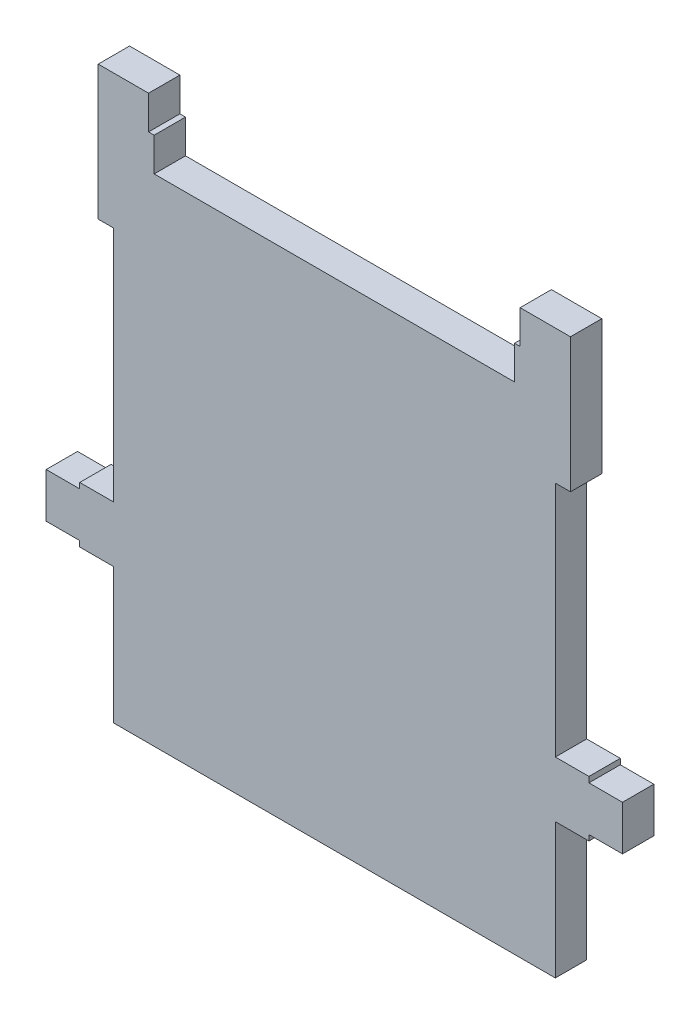
ISO-10303-21;
HEADER;
FILE_DESCRIPTION(('STEP AP214'),'2;1');
FILE_NAME('part.step','',(''),(''),'','','');
FILE_SCHEMA(('AUTOMOTIVE_DESIGN { 1 0 10303 214 1 1 1 1 }'));
ENDSEC;
DATA;
#1=APPLICATION_CONTEXT('core data for automotive mechanical design processes');
#2=APPLICATION_PROTOCOL_DEFINITION('international standard','automotive_design',2000,#1);
#3=PRODUCT_CONTEXT('',#1,'mechanical');
#4=PRODUCT('Part','Part','',(#3));
#5=PRODUCT_RELATED_PRODUCT_CATEGORY('part','',(#4));
#6=PRODUCT_DEFINITION_FORMATION('','',#4);
#7=PRODUCT_DEFINITION_CONTEXT('part definition',#1,'design');
#8=PRODUCT_DEFINITION('design','',#6,#7);
#9=PRODUCT_DEFINITION_SHAPE('','',#8);
#10=(LENGTH_UNIT() NAMED_UNIT(*) SI_UNIT(.MILLI.,.METRE.));
#11=(NAMED_UNIT(*) PLANE_ANGLE_UNIT() SI_UNIT($,.RADIAN.));
#12=(NAMED_UNIT(*) SI_UNIT($,.STERADIAN.) SOLID_ANGLE_UNIT());
#13=UNCERTAINTY_MEASURE_WITH_UNIT(LENGTH_MEASURE(1.E-05),#10,'distance_accuracy_value','');
#14=(GEOMETRIC_REPRESENTATION_CONTEXT(3) GLOBAL_UNCERTAINTY_ASSIGNED_CONTEXT((#13)) GLOBAL_UNIT_ASSIGNED_CONTEXT((#10,
#11,#12)) REPRESENTATION_CONTEXT('',''));
#15=CARTESIAN_POINT('',(0.,0.,0.));
#16=DIRECTION('',(0.,0.,1.));
#17=DIRECTION('',(1.,0.,0.));
#18=AXIS2_PLACEMENT_3D('',#15,#16,#17);
#19=CARTESIAN_POINT('',(-1.97499732,-2.51499878,0.));
#20=DIRECTION('',(0.,0.,-1.));
#21=DIRECTION('',(0.,-1.,0.));
#22=AXIS2_PLACEMENT_3D('',#19,#20,#21);
#23=PLANE('',#22);
#24=DIRECTION('',(0.,1.,0.));
#25=VECTOR('',#24,1.);
#26=CARTESIAN_POINT('',(1.97499986,-1.30499866,0.));
#27=LINE('',#26,#25);
#28=CARTESIAN_POINT('',(1.97499986,-2.51499878,0.));
#29=VERTEX_POINT('',#28);
#30=CARTESIAN_POINT('',(1.97499986,-1.30499866,0.));
#31=VERTEX_POINT('',#30);
#32=EDGE_CURVE('E442',#29,#31,#27,.T.);
#33=ORIENTED_EDGE('',*,*,#32,.F.);
#34=DIRECTION('',(1.,0.,0.));
#35=VECTOR('',#34,1.);
#36=CARTESIAN_POINT('',(1.97499986,-2.51499878,0.));
#37=LINE('',#36,#35);
#38=CARTESIAN_POINT('',(-1.97499732,-2.51499878,0.));
#39=VERTEX_POINT('',#38);
#40=EDGE_CURVE('E323',#39,#29,#37,.T.);
#41=ORIENTED_EDGE('',*,*,#40,.F.);
#42=DIRECTION('',(0.,-1.,0.));
#43=VECTOR('',#42,1.);
#44=CARTESIAN_POINT('',(-1.97499732,-2.51499878,0.));
#45=LINE('',#44,#43);
#46=CARTESIAN_POINT('',(-1.97499732,-1.30499866,0.));
#47=VERTEX_POINT('',#46);
#48=EDGE_CURVE('E11',#47,#39,#45,.T.);
#49=ORIENTED_EDGE('',*,*,#48,.F.);
#50=DIRECTION('',(1.,0.,0.));
#51=VECTOR('',#50,1.);
#52=CARTESIAN_POINT('',(-1.97499732,-1.30499866,0.));
#53=LINE('',#52,#51);
#54=CARTESIAN_POINT('',(-2.27499926,-1.30499866,0.));
#55=VERTEX_POINT('',#54);
#56=EDGE_CURVE('E487',#55,#47,#53,.T.);
#57=ORIENTED_EDGE('',*,*,#56,.F.);
#58=DIRECTION('',(0.,-1.,0.));
#59=VECTOR('',#58,1.);
#60=CARTESIAN_POINT('',(-2.27499926,-1.30499866,0.));
#61=LINE('',#60,#59);
#62=CARTESIAN_POINT('',(-2.27499926,-1.25499876,0.));
#63=VERTEX_POINT('',#62);
#64=EDGE_CURVE('E467',#63,#55,#61,.T.);
#65=ORIENTED_EDGE('',*,*,#64,.F.);
#66=DIRECTION('',(1.,0.,0.));
#67=VECTOR('',#66,1.);
#68=CARTESIAN_POINT('',(-2.27499926,-1.25499876,0.));
#69=LINE('',#68,#67);
#70=CARTESIAN_POINT('',(-2.57499866,-1.25499876,0.));
#71=VERTEX_POINT('',#70);
#72=EDGE_CURVE('E345',#71,#63,#69,.T.);
#73=ORIENTED_EDGE('',*,*,#72,.F.);
#74=DIRECTION('',(0.,-1.,0.));
#75=VECTOR('',#74,1.);
#76=CARTESIAN_POINT('',(-2.57499866,-1.25499876,0.));
#77=LINE('',#76,#75);
#78=CARTESIAN_POINT('',(-2.57499866,-0.85499956,0.));
#79=VERTEX_POINT('',#78);
#80=EDGE_CURVE('E346',#79,#71,#77,.T.);
#81=ORIENTED_EDGE('',*,*,#80,.F.);
#82=DIRECTION('',(-1.,0.,0.));
#83=VECTOR('',#82,1.);
#84=CARTESIAN_POINT('',(-2.57499866,-0.85499956,0.));
#85=LINE('',#84,#83);
#86=CARTESIAN_POINT('',(-2.27499926,-0.85499956,0.));
#87=VERTEX_POINT('',#86);
#88=EDGE_CURVE('E331',#87,#79,#85,.T.);
#89=ORIENTED_EDGE('',*,*,#88,.F.);
#90=DIRECTION('',(0.,-1.,0.));
#91=VECTOR('',#90,1.);
#92=CARTESIAN_POINT('',(-2.27499926,-0.85499956,0.));
#93=LINE('',#92,#91);
#94=CARTESIAN_POINT('',(-2.27499926,-0.80499966,0.));
#95=VERTEX_POINT('',#94);
#96=EDGE_CURVE('E20',#95,#87,#93,.T.);
#97=ORIENTED_EDGE('',*,*,#96,.F.);
#98=DIRECTION('',(-1.,0.,0.));
#99=VECTOR('',#98,1.);
#100=CARTESIAN_POINT('',(-2.27499926,-0.80499966,0.));
#101=LINE('',#100,#99);
#102=CARTESIAN_POINT('',(-1.97499732,-0.80499966,0.));
#103=VERTEX_POINT('',#102);
#104=EDGE_CURVE('E402',#103,#95,#101,.T.);
#105=ORIENTED_EDGE('',*,*,#104,.F.);
#106=DIRECTION('',(0.,-1.,0.));
#107=VECTOR('',#106,1.);
#108=CARTESIAN_POINT('',(-1.97499732,-0.80499966,0.));
#109=LINE('',#108,#107);
#110=CARTESIAN_POINT('',(-1.97499732,1.31500118,0.));
#111=VERTEX_POINT('',#110);
#112=EDGE_CURVE('E391',#111,#103,#109,.T.);
#113=ORIENTED_EDGE('',*,*,#112,.F.);
#114=DIRECTION('',(1.,0.,0.));
#115=VECTOR('',#114,1.);
#116=CARTESIAN_POINT('',(-1.97499732,1.31500118,0.));
#117=LINE('',#116,#115);
#118=CARTESIAN_POINT('',(-2.10999832,1.31500118,0.));
#119=VERTEX_POINT('',#118);
#120=EDGE_CURVE('E405',#119,#111,#117,.T.);
#121=ORIENTED_EDGE('',*,*,#120,.F.);
#122=DIRECTION('',(0.,-1.,0.));
#123=VECTOR('',#122,1.);
#124=CARTESIAN_POINT('',(-2.10999832,1.31500118,0.));
#125=LINE('',#124,#123);
#126=CARTESIAN_POINT('',(-2.10999832,2.51500132,0.));
#127=VERTEX_POINT('',#126);
#128=EDGE_CURVE('E386',#127,#119,#125,.T.);
#129=ORIENTED_EDGE('',*,*,#128,.F.);
#130=DIRECTION('',(-1.,0.,0.));
#131=VECTOR('',#130,1.);
#132=CARTESIAN_POINT('',(-2.10999832,2.51500132,0.));
#133=LINE('',#132,#131);
#134=CARTESIAN_POINT('',(-1.65999922,2.51500132,0.));
#135=VERTEX_POINT('',#134);
#136=EDGE_CURVE('E321',#135,#127,#133,.T.);
#137=ORIENTED_EDGE('',*,*,#136,.F.);
#138=DIRECTION('',(0.,1.,0.));
#139=VECTOR('',#138,1.);
#140=CARTESIAN_POINT('',(-1.65999922,2.51500132,0.));
#141=LINE('',#140,#139);
#142=CARTESIAN_POINT('',(-1.65999922,2.21500192,0.));
#143=VERTEX_POINT('',#142);
#144=EDGE_CURVE('E383',#143,#135,#141,.T.);
#145=ORIENTED_EDGE('',*,*,#144,.F.);
#146=DIRECTION('',(-1.,0.,0.));
#147=VECTOR('',#146,1.);
#148=CARTESIAN_POINT('',(-1.65999922,2.21500192,0.));
#149=LINE('',#148,#147);
#150=CARTESIAN_POINT('',(-1.60999932,2.21500192,0.));
#151=VERTEX_POINT('',#150);
#152=EDGE_CURVE('E465',#151,#143,#149,.T.);
#153=ORIENTED_EDGE('',*,*,#152,.F.);
#154=DIRECTION('',(0.,1.,0.));
#155=VECTOR('',#154,1.);
#156=CARTESIAN_POINT('',(-1.60999932,2.21500192,0.));
#157=LINE('',#156,#155);
#158=CARTESIAN_POINT('',(-1.60999932,1.91499998,0.));
#159=VERTEX_POINT('',#158);
#160=EDGE_CURVE('E466',#159,#151,#157,.T.);
#161=ORIENTED_EDGE('',*,*,#160,.F.);
#162=DIRECTION('',(-1.,0.,0.));
#163=VECTOR('',#162,1.);
#164=CARTESIAN_POINT('',(-1.60999932,1.91499998,0.));
#165=LINE('',#164,#163);
#166=CARTESIAN_POINT('',(1.61000186,1.91499998,0.));
#167=VERTEX_POINT('',#166);
#168=EDGE_CURVE('E525',#167,#159,#165,.T.);
#169=ORIENTED_EDGE('',*,*,#168,.F.);
#170=DIRECTION('',(0.,-1.,0.));
#171=VECTOR('',#170,1.);
#172=CARTESIAN_POINT('',(1.61000186,1.91499998,0.));
#173=LINE('',#172,#171);
#174=CARTESIAN_POINT('',(1.61000186,2.21500192,0.));
#175=VERTEX_POINT('',#174);
#176=EDGE_CURVE('E379',#175,#167,#173,.T.);
#177=ORIENTED_EDGE('',*,*,#176,.F.);
#178=DIRECTION('',(-1.,0.,0.));
#179=VECTOR('',#178,1.);
#180=CARTESIAN_POINT('',(1.61000186,2.21500192,0.));
#181=LINE('',#180,#179);
#182=CARTESIAN_POINT('',(1.66000176,2.21500192,0.));
#183=VERTEX_POINT('',#182);
#184=EDGE_CURVE('E291',#183,#175,#181,.T.);
#185=ORIENTED_EDGE('',*,*,#184,.F.);
#186=DIRECTION('',(0.,-1.,0.));
#187=VECTOR('',#186,1.);
#188=CARTESIAN_POINT('',(1.66000176,2.21500192,0.));
#189=LINE('',#188,#187);
#190=CARTESIAN_POINT('',(1.66000176,2.51500132,0.));
#191=VERTEX_POINT('',#190);
#192=EDGE_CURVE('E285',#191,#183,#189,.T.);
#193=ORIENTED_EDGE('',*,*,#192,.F.);
#194=DIRECTION('',(-1.,0.,0.));
#195=VECTOR('',#194,1.);
#196=CARTESIAN_POINT('',(1.66000176,2.51500132,0.));
#197=LINE('',#196,#195);
#198=CARTESIAN_POINT('',(2.11000086,2.51500132,0.));
#199=VERTEX_POINT('',#198);
#200=EDGE_CURVE('E288',#199,#191,#197,.T.);
#201=ORIENTED_EDGE('',*,*,#200,.F.);
#202=DIRECTION('',(0.,1.,0.));
#203=VECTOR('',#202,1.);
#204=CARTESIAN_POINT('',(2.11000086,2.51500132,0.));
#205=LINE('',#204,#203);
#206=CARTESIAN_POINT('',(2.11000086,1.31500118,0.));
#207=VERTEX_POINT('',#206);
#208=EDGE_CURVE('E317',#207,#199,#205,.T.);
#209=ORIENTED_EDGE('',*,*,#208,.F.);
#210=DIRECTION('',(1.,0.,0.));
#211=VECTOR('',#210,1.);
#212=CARTESIAN_POINT('',(2.11000086,1.31500118,0.));
#213=LINE('',#212,#211);
#214=CARTESIAN_POINT('',(1.97499986,1.31500118,0.));
#215=VERTEX_POINT('',#214);
#216=EDGE_CURVE('E365',#215,#207,#213,.T.);
#217=ORIENTED_EDGE('',*,*,#216,.F.);
#218=DIRECTION('',(0.,1.,0.));
#219=VECTOR('',#218,1.);
#220=CARTESIAN_POINT('',(1.97499986,1.31500118,0.));
#221=LINE('',#220,#219);
#222=CARTESIAN_POINT('',(1.97499986,-0.80499966,0.));
#223=VERTEX_POINT('',#222);
#224=EDGE_CURVE('E352',#223,#215,#221,.T.);
#225=ORIENTED_EDGE('',*,*,#224,.F.);
#226=DIRECTION('',(-1.,0.,0.));
#227=VECTOR('',#226,1.);
#228=CARTESIAN_POINT('',(1.97499986,-0.80499966,0.));
#229=LINE('',#228,#227);
#230=CARTESIAN_POINT('',(2.2750018,-0.80499966,0.));
#231=VERTEX_POINT('',#230);
#232=EDGE_CURVE('E350',#231,#223,#229,.T.);
#233=ORIENTED_EDGE('',*,*,#232,.F.);
#234=DIRECTION('',(0.,1.,0.));
#235=VECTOR('',#234,1.);
#236=CARTESIAN_POINT('',(2.2750018,-0.80499966,0.));
#237=LINE('',#236,#235);
#238=CARTESIAN_POINT('',(2.2750018,-0.85499956,0.));
#239=VERTEX_POINT('',#238);
#240=EDGE_CURVE('E351',#239,#231,#237,.T.);
#241=ORIENTED_EDGE('',*,*,#240,.F.);
#242=DIRECTION('',(-1.,0.,0.));
#243=VECTOR('',#242,1.);
#244=CARTESIAN_POINT('',(2.2750018,-0.85499956,0.));
#245=LINE('',#244,#243);
#246=CARTESIAN_POINT('',(2.5750012,-0.85499956,0.));
#247=VERTEX_POINT('',#246);
#248=EDGE_CURVE('E516',#247,#239,#245,.T.);
#249=ORIENTED_EDGE('',*,*,#248,.F.);
#250=DIRECTION('',(0.,1.,0.));
#251=VECTOR('',#250,1.);
#252=CARTESIAN_POINT('',(2.5750012,-0.85499956,0.));
#253=LINE('',#252,#251);
#254=CARTESIAN_POINT('',(2.5750012,-1.25499876,0.));
#255=VERTEX_POINT('',#254);
#256=EDGE_CURVE('E456',#255,#247,#253,.T.);
#257=ORIENTED_EDGE('',*,*,#256,.F.);
#258=DIRECTION('',(1.,0.,0.));
#259=VECTOR('',#258,1.);
#260=CARTESIAN_POINT('',(2.5750012,-1.25499876,0.));
#261=LINE('',#260,#259);
#262=CARTESIAN_POINT('',(2.2750018,-1.25499876,0.));
#263=VERTEX_POINT('',#262);
#264=EDGE_CURVE('E454',#263,#255,#261,.T.);
#265=ORIENTED_EDGE('',*,*,#264,.F.);
#266=DIRECTION('',(0.,1.,0.));
#267=VECTOR('',#266,1.);
#268=CARTESIAN_POINT('',(2.2750018,-1.25499876,0.));
#269=LINE('',#268,#267);
#270=CARTESIAN_POINT('',(2.2750018,-1.30499866,0.));
#271=VERTEX_POINT('',#270);
#272=EDGE_CURVE('E455',#271,#263,#269,.T.);
#273=ORIENTED_EDGE('',*,*,#272,.F.);
#274=DIRECTION('',(1.,0.,0.));
#275=VECTOR('',#274,1.);
#276=CARTESIAN_POINT('',(2.2750018,-1.30499866,0.));
#277=LINE('',#276,#275);
#278=EDGE_CURVE('E370',#31,#271,#277,.T.);
#279=ORIENTED_EDGE('',*,*,#278,.F.);
#280=EDGE_LOOP('',(#33,#41,#49,#57,#65,#73,#81,#89,#97,#105,#113,#121,#129,#137,#145,#153,#161,
#169,#177,#185,#193,#201,#209,#217,#225,#233,#241,#249,#257,#265,#273,#279));
#281=FACE_BOUND('',#280,.T.);
#282=ADVANCED_FACE('F16',(#281),#23,.T.);
#283=CARTESIAN_POINT('',(-1.97499732,-2.51499878,0.));
#284=DIRECTION('',(-1.,0.,0.));
#285=DIRECTION('',(0.,0.,1.));
#286=AXIS2_PLACEMENT_3D('',#283,#284,#285);
#287=PLANE('',#286);
#288=DIRECTION('',(0.,0.,1.));
#289=VECTOR('',#288,1.);
#290=CARTESIAN_POINT('',(-1.97499732,-1.30499866,0.));
#291=LINE('',#290,#289);
#292=CARTESIAN_POINT('',(-1.97499732,-1.30499866,0.27999944));
#293=VERTEX_POINT('',#292);
#294=EDGE_CURVE('E27',#47,#293,#291,.T.);
#295=ORIENTED_EDGE('',*,*,#294,.F.);
#296=ORIENTED_EDGE('',*,*,#48,.T.);
#297=DIRECTION('',(0.,0.,-1.));
#298=VECTOR('',#297,1.);
#299=CARTESIAN_POINT('',(-1.97499732,-2.51499878,0.));
#300=LINE('',#299,#298);
#301=CARTESIAN_POINT('',(-1.97499732,-2.51499878,0.27999944));
#302=VERTEX_POINT('',#301);
#303=EDGE_CURVE('E327',#302,#39,#300,.T.);
#304=ORIENTED_EDGE('',*,*,#303,.F.);
#305=DIRECTION('',(0.,1.,0.));
#306=VECTOR('',#305,1.);
#307=CARTESIAN_POINT('',(-1.97499732,-2.51499878,0.27999944));
#308=LINE('',#307,#306);
#309=EDGE_CURVE('E552',#302,#293,#308,.T.);
#310=ORIENTED_EDGE('',*,*,#309,.T.);
#311=EDGE_LOOP('',(#295,#296,#304,#310));
#312=FACE_BOUND('',#311,.T.);
#313=ADVANCED_FACE('F666',(#312),#287,.T.);
#314=CARTESIAN_POINT('',(-1.97499732,-1.30499866,0.));
#315=DIRECTION('',(0.,-1.,0.));
#316=DIRECTION('',(0.,0.,-1.));
#317=AXIS2_PLACEMENT_3D('',#314,#315,#316);
#318=PLANE('',#317);
#319=DIRECTION('',(0.,0.,1.));
#320=VECTOR('',#319,1.);
#321=CARTESIAN_POINT('',(-2.27499926,-1.30499866,0.));
#322=LINE('',#321,#320);
#323=CARTESIAN_POINT('',(-2.27499926,-1.30499866,0.27999944));
#324=VERTEX_POINT('',#323);
#325=EDGE_CURVE('E471',#55,#324,#322,.T.);
#326=ORIENTED_EDGE('',*,*,#325,.F.);
#327=ORIENTED_EDGE('',*,*,#56,.T.);
#328=ORIENTED_EDGE('',*,*,#294,.T.);
#329=DIRECTION('',(-1.,0.,0.));
#330=VECTOR('',#329,1.);
#331=CARTESIAN_POINT('',(-1.97499732,-1.30499866,0.27999944));
#332=LINE('',#331,#330);
#333=EDGE_CURVE('E521',#293,#324,#332,.T.);
#334=ORIENTED_EDGE('',*,*,#333,.T.);
#335=EDGE_LOOP('',(#326,#327,#328,#334));
#336=FACE_BOUND('',#335,.T.);
#337=ADVANCED_FACE('F664',(#336),#318,.T.);
#338=CARTESIAN_POINT('',(-2.27499926,-1.30499866,0.));
#339=DIRECTION('',(-1.,0.,0.));
#340=DIRECTION('',(0.,0.,1.));
#341=AXIS2_PLACEMENT_3D('',#338,#339,#340);
#342=PLANE('',#341);
#343=DIRECTION('',(0.,0.,1.));
#344=VECTOR('',#343,1.);
#345=CARTESIAN_POINT('',(-2.27499926,-1.25499876,0.));
#346=LINE('',#345,#344);
#347=CARTESIAN_POINT('',(-2.27499926,-1.25499876,0.27999944));
#348=VERTEX_POINT('',#347);
#349=EDGE_CURVE('E361',#63,#348,#346,.T.);
#350=ORIENTED_EDGE('',*,*,#349,.F.);
#351=ORIENTED_EDGE('',*,*,#64,.T.);
#352=ORIENTED_EDGE('',*,*,#325,.T.);
#353=DIRECTION('',(0.,1.,0.));
#354=VECTOR('',#353,1.);
#355=CARTESIAN_POINT('',(-2.27499926,-2.51499878,0.27999944));
#356=LINE('',#355,#354);
#357=EDGE_CURVE('E517',#324,#348,#356,.T.);
#358=ORIENTED_EDGE('',*,*,#357,.T.);
#359=EDGE_LOOP('',(#350,#351,#352,#358));
#360=FACE_BOUND('',#359,.T.);
#361=ADVANCED_FACE('F659',(#360),#342,.T.);
#362=CARTESIAN_POINT('',(-2.27499926,-1.25499876,0.));
#363=DIRECTION('',(0.,-1.,0.));
#364=DIRECTION('',(0.,0.,-1.));
#365=AXIS2_PLACEMENT_3D('',#362,#363,#364);
#366=PLANE('',#365);
#367=DIRECTION('',(0.,0.,1.));
#368=VECTOR('',#367,1.);
#369=CARTESIAN_POINT('',(-2.57499866,-1.25499876,0.));
#370=LINE('',#369,#368);
#371=CARTESIAN_POINT('',(-2.57499866,-1.25499876,0.27999944));
#372=VERTEX_POINT('',#371);
#373=EDGE_CURVE('E342',#71,#372,#370,.T.);
#374=ORIENTED_EDGE('',*,*,#373,.F.);
#375=ORIENTED_EDGE('',*,*,#72,.T.);
#376=ORIENTED_EDGE('',*,*,#349,.T.);
#377=DIRECTION('',(-1.,0.,0.));
#378=VECTOR('',#377,1.);
#379=CARTESIAN_POINT('',(-1.97499732,-1.25499876,0.27999944));
#380=LINE('',#379,#378);
#381=EDGE_CURVE('E498',#348,#372,#380,.T.);
#382=ORIENTED_EDGE('',*,*,#381,.T.);
#383=EDGE_LOOP('',(#374,#375,#376,#382));
#384=FACE_BOUND('',#383,.T.);
#385=ADVANCED_FACE('F645',(#384),#366,.T.);
#386=CARTESIAN_POINT('',(-2.57499866,-1.25499876,0.));
#387=DIRECTION('',(-1.,0.,0.));
#388=DIRECTION('',(0.,0.,1.));
#389=AXIS2_PLACEMENT_3D('',#386,#387,#388);
#390=PLANE('',#389);
#391=DIRECTION('',(0.,0.,1.));
#392=VECTOR('',#391,1.);
#393=CARTESIAN_POINT('',(-2.57499866,-0.85499956,0.));
#394=LINE('',#393,#392);
#395=CARTESIAN_POINT('',(-2.57499866,-0.85499956,0.27999944));
#396=VERTEX_POINT('',#395);
#397=EDGE_CURVE('E423',#79,#396,#394,.T.);
#398=ORIENTED_EDGE('',*,*,#397,.F.);
#399=ORIENTED_EDGE('',*,*,#80,.T.);
#400=ORIENTED_EDGE('',*,*,#373,.T.);
#401=DIRECTION('',(0.,1.,0.));
#402=VECTOR('',#401,1.);
#403=CARTESIAN_POINT('',(-2.57499866,-2.51499878,0.27999944));
#404=LINE('',#403,#402);
#405=EDGE_CURVE('E340',#372,#396,#404,.T.);
#406=ORIENTED_EDGE('',*,*,#405,.T.);
#407=EDGE_LOOP('',(#398,#399,#400,#406));
#408=FACE_BOUND('',#407,.T.);
#409=ADVANCED_FACE('F655',(#408),#390,.T.);
#410=CARTESIAN_POINT('',(-2.57499866,-0.85499956,0.));
#411=DIRECTION('',(0.,1.,0.));
#412=DIRECTION('',(1.,0.,0.));
#413=AXIS2_PLACEMENT_3D('',#410,#411,#412);
#414=PLANE('',#413);
#415=DIRECTION('',(0.,0.,1.));
#416=VECTOR('',#415,1.);
#417=CARTESIAN_POINT('',(-2.27499926,-0.85499956,0.));
#418=LINE('',#417,#416);
#419=CARTESIAN_POINT('',(-2.27499926,-0.85499956,0.27999944));
#420=VERTEX_POINT('',#419);
#421=EDGE_CURVE('E328',#87,#420,#418,.T.);
#422=ORIENTED_EDGE('',*,*,#421,.F.);
#423=ORIENTED_EDGE('',*,*,#88,.T.);
#424=ORIENTED_EDGE('',*,*,#397,.T.);
#425=DIRECTION('',(1.,0.,0.));
#426=VECTOR('',#425,1.);
#427=CARTESIAN_POINT('',(-1.97499732,-0.85499956,0.27999944));
#428=LINE('',#427,#426);
#429=EDGE_CURVE('E336',#396,#420,#428,.T.);
#430=ORIENTED_EDGE('',*,*,#429,.T.);
#431=EDGE_LOOP('',(#422,#423,#424,#430));
#432=FACE_BOUND('',#431,.T.);
#433=ADVANCED_FACE('F974',(#432),#414,.T.);
#434=CARTESIAN_POINT('',(-2.27499926,-0.85499956,0.));
#435=DIRECTION('',(-1.,0.,0.));
#436=DIRECTION('',(0.,0.,1.));
#437=AXIS2_PLACEMENT_3D('',#434,#435,#436);
#438=PLANE('',#437);
#439=DIRECTION('',(0.,0.,1.));
#440=VECTOR('',#439,1.);
#441=CARTESIAN_POINT('',(-2.27499926,-0.80499966,0.));
#442=LINE('',#441,#440);
#443=CARTESIAN_POINT('',(-2.27499926,-0.80499966,0.27999944));
#444=VERTEX_POINT('',#443);
#445=EDGE_CURVE('E630',#95,#444,#442,.T.);
#446=ORIENTED_EDGE('',*,*,#445,.F.);
#447=ORIENTED_EDGE('',*,*,#96,.T.);
#448=ORIENTED_EDGE('',*,*,#421,.T.);
#449=DIRECTION('',(0.,1.,0.));
#450=VECTOR('',#449,1.);
#451=CARTESIAN_POINT('',(-2.27499926,-2.51499878,0.27999944));
#452=LINE('',#451,#450);
#453=EDGE_CURVE('E341',#420,#444,#452,.T.);
#454=ORIENTED_EDGE('',*,*,#453,.T.);
#455=EDGE_LOOP('',(#446,#447,#448,#454));
#456=FACE_BOUND('',#455,.T.);
#457=ADVANCED_FACE('F692',(#456),#438,.T.);
#458=CARTESIAN_POINT('',(-2.27499926,-0.80499966,0.));
#459=DIRECTION('',(0.,1.,0.));
#460=DIRECTION('',(1.,0.,0.));
#461=AXIS2_PLACEMENT_3D('',#458,#459,#460);
#462=PLANE('',#461);
#463=DIRECTION('',(0.,0.,1.));
#464=VECTOR('',#463,1.);
#465=CARTESIAN_POINT('',(-1.97499732,-0.80499966,0.));
#466=LINE('',#465,#464);
#467=CARTESIAN_POINT('',(-1.97499732,-0.80499966,0.27999944));
#468=VERTEX_POINT('',#467);
#469=EDGE_CURVE('E394',#103,#468,#466,.T.);
#470=ORIENTED_EDGE('',*,*,#469,.F.);
#471=ORIENTED_EDGE('',*,*,#104,.T.);
#472=ORIENTED_EDGE('',*,*,#445,.T.);
#473=DIRECTION('',(1.,0.,0.));
#474=VECTOR('',#473,1.);
#475=CARTESIAN_POINT('',(-1.97499732,-0.80499966,0.27999944));
#476=LINE('',#475,#474);
#477=EDGE_CURVE('E478',#444,#468,#476,.T.);
#478=ORIENTED_EDGE('',*,*,#477,.T.);
#479=EDGE_LOOP('',(#470,#471,#472,#478));
#480=FACE_BOUND('',#479,.T.);
#481=ADVANCED_FACE('F688',(#480),#462,.T.);
#482=CARTESIAN_POINT('',(-1.97499732,-0.80499966,0.));
#483=DIRECTION('',(-1.,0.,0.));
#484=DIRECTION('',(0.,0.,1.));
#485=AXIS2_PLACEMENT_3D('',#482,#483,#484);
#486=PLANE('',#485);
#487=DIRECTION('',(0.,0.,1.));
#488=VECTOR('',#487,1.);
#489=CARTESIAN_POINT('',(-1.97499732,1.31500118,0.));
#490=LINE('',#489,#488);
#491=CARTESIAN_POINT('',(-1.97499732,1.31500118,0.27999944));
#492=VERTEX_POINT('',#491);
#493=EDGE_CURVE('E395',#111,#492,#490,.T.);
#494=ORIENTED_EDGE('',*,*,#493,.F.);
#495=ORIENTED_EDGE('',*,*,#112,.T.);
#496=ORIENTED_EDGE('',*,*,#469,.T.);
#497=DIRECTION('',(0.,1.,0.));
#498=VECTOR('',#497,1.);
#499=CARTESIAN_POINT('',(-1.97499732,-2.51499878,0.27999944));
#500=LINE('',#499,#498);
#501=EDGE_CURVE('E482',#468,#492,#500,.T.);
#502=ORIENTED_EDGE('',*,*,#501,.T.);
#503=EDGE_LOOP('',(#494,#495,#496,#502));
#504=FACE_BOUND('',#503,.T.);
#505=ADVANCED_FACE('F697',(#504),#486,.T.);
#506=CARTESIAN_POINT('',(-1.97499732,1.31500118,0.));
#507=DIRECTION('',(0.,-1.,0.));
#508=DIRECTION('',(0.,0.,-1.));
#509=AXIS2_PLACEMENT_3D('',#506,#507,#508);
#510=PLANE('',#509);
#511=DIRECTION('',(0.,0.,1.));
#512=VECTOR('',#511,1.);
#513=CARTESIAN_POINT('',(-2.10999832,1.31500118,0.));
#514=LINE('',#513,#512);
#515=CARTESIAN_POINT('',(-2.10999832,1.31500118,0.27999944));
#516=VERTEX_POINT('',#515);
#517=EDGE_CURVE('E389',#119,#516,#514,.T.);
#518=ORIENTED_EDGE('',*,*,#517,.F.);
#519=ORIENTED_EDGE('',*,*,#120,.T.);
#520=ORIENTED_EDGE('',*,*,#493,.T.);
#521=DIRECTION('',(-1.,0.,0.));
#522=VECTOR('',#521,1.);
#523=CARTESIAN_POINT('',(-1.97499732,1.31500118,0.27999944));
#524=LINE('',#523,#522);
#525=EDGE_CURVE('E571',#492,#516,#524,.T.);
#526=ORIENTED_EDGE('',*,*,#525,.T.);
#527=EDGE_LOOP('',(#518,#519,#520,#526));
#528=FACE_BOUND('',#527,.T.);
#529=ADVANCED_FACE('F699',(#528),#510,.T.);
#530=CARTESIAN_POINT('',(-2.10999832,1.31500118,0.));
#531=DIRECTION('',(-1.,0.,0.));
#532=DIRECTION('',(0.,0.,1.));
#533=AXIS2_PLACEMENT_3D('',#530,#531,#532);
#534=PLANE('',#533);
#535=DIRECTION('',(0.,0.,1.));
#536=VECTOR('',#535,1.);
#537=CARTESIAN_POINT('',(-2.10999832,2.51500132,0.));
#538=LINE('',#537,#536);
#539=CARTESIAN_POINT('',(-2.10999832,2.51500132,0.27999944));
#540=VERTEX_POINT('',#539);
#541=EDGE_CURVE('E390',#127,#540,#538,.T.);
#542=ORIENTED_EDGE('',*,*,#541,.F.);
#543=ORIENTED_EDGE('',*,*,#128,.T.);
#544=ORIENTED_EDGE('',*,*,#517,.T.);
#545=DIRECTION('',(0.,1.,0.));
#546=VECTOR('',#545,1.);
#547=CARTESIAN_POINT('',(-2.10999832,-2.51499878,0.27999944));
#548=LINE('',#547,#546);
#549=EDGE_CURVE('E574',#516,#540,#548,.T.);
#550=ORIENTED_EDGE('',*,*,#549,.T.);
#551=EDGE_LOOP('',(#542,#543,#544,#550));
#552=FACE_BOUND('',#551,.T.);
#553=ADVANCED_FACE('F704',(#552),#534,.T.);
#554=CARTESIAN_POINT('',(-2.10999832,2.51500132,0.));
#555=DIRECTION('',(0.,1.,0.));
#556=DIRECTION('',(1.,0.,0.));
#557=AXIS2_PLACEMENT_3D('',#554,#555,#556);
#558=PLANE('',#557);
#559=DIRECTION('',(0.,0.,1.));
#560=VECTOR('',#559,1.);
#561=CARTESIAN_POINT('',(-1.65999922,2.51500132,0.));
#562=LINE('',#561,#560);
#563=CARTESIAN_POINT('',(-1.65999922,2.51500132,0.27999944));
#564=VERTEX_POINT('',#563);
#565=EDGE_CURVE('E380',#135,#564,#562,.T.);
#566=ORIENTED_EDGE('',*,*,#565,.F.);
#567=ORIENTED_EDGE('',*,*,#136,.T.);
#568=ORIENTED_EDGE('',*,*,#541,.T.);
#569=DIRECTION('',(1.,0.,0.));
#570=VECTOR('',#569,1.);
#571=CARTESIAN_POINT('',(-1.97499732,2.51500132,0.27999944));
#572=LINE('',#571,#570);
#573=EDGE_CURVE('E590',#540,#564,#572,.T.);
#574=ORIENTED_EDGE('',*,*,#573,.T.);
#575=EDGE_LOOP('',(#566,#567,#568,#574));
#576=FACE_BOUND('',#575,.T.);
#577=ADVANCED_FACE('F707',(#576),#558,.T.);
#578=CARTESIAN_POINT('',(-1.65999922,2.51500132,0.));
#579=DIRECTION('',(1.,0.,0.));
#580=DIRECTION('',(0.,1.,0.));
#581=AXIS2_PLACEMENT_3D('',#578,#579,#580);
#582=PLANE('',#581);
#583=DIRECTION('',(0.,0.,1.));
#584=VECTOR('',#583,1.);
#585=CARTESIAN_POINT('',(-1.65999922,2.21500192,0.));
#586=LINE('',#585,#584);
#587=CARTESIAN_POINT('',(-1.65999922,2.21500192,0.27999944));
#588=VERTEX_POINT('',#587);
#589=EDGE_CURVE('E505',#143,#588,#586,.T.);
#590=ORIENTED_EDGE('',*,*,#589,.F.);
#591=ORIENTED_EDGE('',*,*,#144,.T.);
#592=ORIENTED_EDGE('',*,*,#565,.T.);
#593=DIRECTION('',(0.,-1.,0.));
#594=VECTOR('',#593,1.);
#595=CARTESIAN_POINT('',(-1.65999922,-2.51499878,0.27999944));
#596=LINE('',#595,#594);
#597=EDGE_CURVE('E486',#564,#588,#596,.T.);
#598=ORIENTED_EDGE('',*,*,#597,.T.);
#599=EDGE_LOOP('',(#590,#591,#592,#598));
#600=FACE_BOUND('',#599,.T.);
#601=ADVANCED_FACE('F792',(#600),#582,.T.);
#602=CARTESIAN_POINT('',(-1.65999922,2.21500192,0.));
#603=DIRECTION('',(0.,1.,0.));
#604=DIRECTION('',(1.,0.,0.));
#605=AXIS2_PLACEMENT_3D('',#602,#603,#604);
#606=PLANE('',#605);
#607=DIRECTION('',(0.,0.,1.));
#608=VECTOR('',#607,1.);
#609=CARTESIAN_POINT('',(-1.60999932,2.21500192,0.));
#610=LINE('',#609,#608);
#611=CARTESIAN_POINT('',(-1.60999932,2.21500192,0.27999944));
#612=VERTEX_POINT('',#611);
#613=EDGE_CURVE('E462',#151,#612,#610,.T.);
#614=ORIENTED_EDGE('',*,*,#613,.F.);
#615=ORIENTED_EDGE('',*,*,#152,.T.);
#616=ORIENTED_EDGE('',*,*,#589,.T.);
#617=DIRECTION('',(1.,0.,0.));
#618=VECTOR('',#617,1.);
#619=CARTESIAN_POINT('',(-1.97499732,2.21500192,0.27999944));
#620=LINE('',#619,#618);
#621=EDGE_CURVE('E475',#588,#612,#620,.T.);
#622=ORIENTED_EDGE('',*,*,#621,.T.);
#623=EDGE_LOOP('',(#614,#615,#616,#622));
#624=FACE_BOUND('',#623,.T.);
#625=ADVANCED_FACE('F796',(#624),#606,.T.);
#626=CARTESIAN_POINT('',(-1.60999932,2.21500192,0.));
#627=DIRECTION('',(1.,0.,0.));
#628=DIRECTION('',(0.,1.,0.));
#629=AXIS2_PLACEMENT_3D('',#626,#627,#628);
#630=PLANE('',#629);
#631=DIRECTION('',(0.,0.,1.));
#632=VECTOR('',#631,1.);
#633=CARTESIAN_POINT('',(-1.60999932,1.91499998,0.));
#634=LINE('',#633,#632);
#635=CARTESIAN_POINT('',(-1.60999932,1.91499998,0.27999944));
#636=VERTEX_POINT('',#635);
#637=EDGE_CURVE('E419',#159,#636,#634,.T.);
#638=ORIENTED_EDGE('',*,*,#637,.F.);
#639=ORIENTED_EDGE('',*,*,#160,.T.);
#640=ORIENTED_EDGE('',*,*,#613,.T.);
#641=DIRECTION('',(0.,-1.,0.));
#642=VECTOR('',#641,1.);
#643=CARTESIAN_POINT('',(-1.60999932,-2.51499878,0.27999944));
#644=LINE('',#643,#642);
#645=EDGE_CURVE('E472',#612,#636,#644,.T.);
#646=ORIENTED_EDGE('',*,*,#645,.T.);
#647=EDGE_LOOP('',(#638,#639,#640,#646));
#648=FACE_BOUND('',#647,.T.);
#649=ADVANCED_FACE('F992',(#648),#630,.T.);
#650=CARTESIAN_POINT('',(-1.60999932,1.91499998,0.));
#651=DIRECTION('',(0.,1.,0.));
#652=DIRECTION('',(1.,0.,0.));
#653=AXIS2_PLACEMENT_3D('',#650,#651,#652);
#654=PLANE('',#653);
#655=DIRECTION('',(0.,0.,1.));
#656=VECTOR('',#655,1.);
#657=CARTESIAN_POINT('',(1.61000186,1.91499998,0.));
#658=LINE('',#657,#656);
#659=CARTESIAN_POINT('',(1.61000186,1.91499998,0.27999944));
#660=VERTEX_POINT('',#659);
#661=EDGE_CURVE('E529',#167,#660,#658,.T.);
#662=ORIENTED_EDGE('',*,*,#661,.F.);
#663=ORIENTED_EDGE('',*,*,#168,.T.);
#664=ORIENTED_EDGE('',*,*,#637,.T.);
#665=DIRECTION('',(1.,0.,0.));
#666=VECTOR('',#665,1.);
#667=CARTESIAN_POINT('',(-1.97499732,1.91499998,0.27999944));
#668=LINE('',#667,#666);
#669=EDGE_CURVE('E476',#636,#660,#668,.T.);
#670=ORIENTED_EDGE('',*,*,#669,.T.);
#671=EDGE_LOOP('',(#662,#663,#664,#670));
#672=FACE_BOUND('',#671,.T.);
#673=ADVANCED_FACE('F18',(#672),#654,.T.);
#674=CARTESIAN_POINT('',(1.61000186,1.91499998,0.));
#675=DIRECTION('',(-1.,0.,0.));
#676=DIRECTION('',(0.,0.,1.));
#677=AXIS2_PLACEMENT_3D('',#674,#675,#676);
#678=PLANE('',#677);
#679=DIRECTION('',(0.,0.,1.));
#680=VECTOR('',#679,1.);
#681=CARTESIAN_POINT('',(1.61000186,2.21500192,0.));
#682=LINE('',#681,#680);
#683=CARTESIAN_POINT('',(1.61000186,2.21500192,0.27999944));
#684=VERTEX_POINT('',#683);
#685=EDGE_CURVE('E376',#175,#684,#682,.T.);
#686=ORIENTED_EDGE('',*,*,#685,.F.);
#687=ORIENTED_EDGE('',*,*,#176,.T.);
#688=ORIENTED_EDGE('',*,*,#661,.T.);
#689=DIRECTION('',(0.,1.,0.));
#690=VECTOR('',#689,1.);
#691=CARTESIAN_POINT('',(1.61000186,-2.51499878,0.27999944));
#692=LINE('',#691,#690);
#693=EDGE_CURVE('E494',#660,#684,#692,.T.);
#694=ORIENTED_EDGE('',*,*,#693,.T.);
#695=EDGE_LOOP('',(#686,#687,#688,#694));
#696=FACE_BOUND('',#695,.T.);
#697=ADVANCED_FACE('F880',(#696),#678,.T.);
#698=CARTESIAN_POINT('',(1.61000186,2.21500192,0.));
#699=DIRECTION('',(0.,1.,0.));
#700=DIRECTION('',(1.,0.,0.));
#701=AXIS2_PLACEMENT_3D('',#698,#699,#700);
#702=PLANE('',#701);
#703=DIRECTION('',(0.,0.,1.));
#704=VECTOR('',#703,1.);
#705=CARTESIAN_POINT('',(1.66000176,2.21500192,0.));
#706=LINE('',#705,#704);
#707=CARTESIAN_POINT('',(1.66000176,2.21500192,0.27999944));
#708=VERTEX_POINT('',#707);
#709=EDGE_CURVE('E295',#183,#708,#706,.T.);
#710=ORIENTED_EDGE('',*,*,#709,.F.);
#711=ORIENTED_EDGE('',*,*,#184,.T.);
#712=ORIENTED_EDGE('',*,*,#685,.T.);
#713=DIRECTION('',(1.,0.,0.));
#714=VECTOR('',#713,1.);
#715=CARTESIAN_POINT('',(-1.97499732,2.21500192,0.27999944));
#716=LINE('',#715,#714);
#717=EDGE_CURVE('E334',#684,#708,#716,.T.);
#718=ORIENTED_EDGE('',*,*,#717,.T.);
#719=EDGE_LOOP('',(#710,#711,#712,#718));
#720=FACE_BOUND('',#719,.T.);
#721=ADVANCED_FACE('F876',(#720),#702,.T.);
#722=CARTESIAN_POINT('',(1.66000176,2.21500192,0.));
#723=DIRECTION('',(-1.,0.,0.));
#724=DIRECTION('',(0.,0.,1.));
#725=AXIS2_PLACEMENT_3D('',#722,#723,#724);
#726=PLANE('',#725);
#727=DIRECTION('',(0.,0.,1.));
#728=VECTOR('',#727,1.);
#729=CARTESIAN_POINT('',(1.66000176,2.51500132,0.));
#730=LINE('',#729,#728);
#731=CARTESIAN_POINT('',(1.66000176,2.51500132,0.27999944));
#732=VERTEX_POINT('',#731);
#733=EDGE_CURVE('E296',#191,#732,#730,.T.);
#734=ORIENTED_EDGE('',*,*,#733,.F.);
#735=ORIENTED_EDGE('',*,*,#192,.T.);
#736=ORIENTED_EDGE('',*,*,#709,.T.);
#737=DIRECTION('',(0.,1.,0.));
#738=VECTOR('',#737,1.);
#739=CARTESIAN_POINT('',(1.66000176,-2.51499878,0.27999944));
#740=LINE('',#739,#738);
#741=EDGE_CURVE('E301',#708,#732,#740,.T.);
#742=ORIENTED_EDGE('',*,*,#741,.T.);
#743=EDGE_LOOP('',(#734,#735,#736,#742));
#744=FACE_BOUND('',#743,.T.);
#745=ADVANCED_FACE('F299',(#744),#726,.T.);
#746=CARTESIAN_POINT('',(1.66000176,2.51500132,0.));
#747=DIRECTION('',(0.,1.,0.));
#748=DIRECTION('',(1.,0.,0.));
#749=AXIS2_PLACEMENT_3D('',#746,#747,#748);
#750=PLANE('',#749);
#751=DIRECTION('',(0.,0.,1.));
#752=VECTOR('',#751,1.);
#753=CARTESIAN_POINT('',(2.11000086,2.51500132,0.));
#754=LINE('',#753,#752);
#755=CARTESIAN_POINT('',(2.11000086,2.51500132,0.27999944));
#756=VERTEX_POINT('',#755);
#757=EDGE_CURVE('E308',#199,#756,#754,.T.);
#758=ORIENTED_EDGE('',*,*,#757,.F.);
#759=ORIENTED_EDGE('',*,*,#200,.T.);
#760=ORIENTED_EDGE('',*,*,#733,.T.);
#761=DIRECTION('',(1.,0.,0.));
#762=VECTOR('',#761,1.);
#763=CARTESIAN_POINT('',(-1.97499732,2.51500132,0.27999944));
#764=LINE('',#763,#762);
#765=EDGE_CURVE('E335',#732,#756,#764,.T.);
#766=ORIENTED_EDGE('',*,*,#765,.T.);
#767=EDGE_LOOP('',(#758,#759,#760,#766));
#768=FACE_BOUND('',#767,.T.);
#769=ADVANCED_FACE('F307',(#768),#750,.T.);
#770=CARTESIAN_POINT('',(2.11000086,2.51500132,0.));
#771=DIRECTION('',(1.,0.,0.));
#772=DIRECTION('',(0.,1.,0.));
#773=AXIS2_PLACEMENT_3D('',#770,#771,#772);
#774=PLANE('',#773);
#775=DIRECTION('',(0.,0.,1.));
#776=VECTOR('',#775,1.);
#777=CARTESIAN_POINT('',(2.11000086,1.31500118,0.));
#778=LINE('',#777,#776);
#779=CARTESIAN_POINT('',(2.11000086,1.31500118,0.27999944));
#780=VERTEX_POINT('',#779);
#781=EDGE_CURVE('E369',#207,#780,#778,.T.);
#782=ORIENTED_EDGE('',*,*,#781,.F.);
#783=ORIENTED_EDGE('',*,*,#208,.T.);
#784=ORIENTED_EDGE('',*,*,#757,.T.);
#785=DIRECTION('',(0.,-1.,0.));
#786=VECTOR('',#785,1.);
#787=CARTESIAN_POINT('',(2.11000086,-2.51499878,0.27999944));
#788=LINE('',#787,#786);
#789=EDGE_CURVE('E364',#756,#780,#788,.T.);
#790=ORIENTED_EDGE('',*,*,#789,.T.);
#791=EDGE_LOOP('',(#782,#783,#784,#790));
#792=FACE_BOUND('',#791,.T.);
#793=ADVANCED_FACE('F836',(#792),#774,.T.);
#794=CARTESIAN_POINT('',(2.11000086,1.31500118,0.));
#795=DIRECTION('',(0.,-1.,0.));
#796=DIRECTION('',(0.,0.,-1.));
#797=AXIS2_PLACEMENT_3D('',#794,#795,#796);
#798=PLANE('',#797);
#799=DIRECTION('',(0.,0.,1.));
#800=VECTOR('',#799,1.);
#801=CARTESIAN_POINT('',(1.97499986,1.31500118,0.));
#802=LINE('',#801,#800);
#803=CARTESIAN_POINT('',(1.97499986,1.31500118,0.27999944));
#804=VERTEX_POINT('',#803);
#805=EDGE_CURVE('E356',#215,#804,#802,.T.);
#806=ORIENTED_EDGE('',*,*,#805,.F.);
#807=ORIENTED_EDGE('',*,*,#216,.T.);
#808=ORIENTED_EDGE('',*,*,#781,.T.);
#809=DIRECTION('',(-1.,0.,0.));
#810=VECTOR('',#809,1.);
#811=CARTESIAN_POINT('',(-1.97499732,1.31500118,0.27999944));
#812=LINE('',#811,#810);
#813=EDGE_CURVE('E504',#780,#804,#812,.T.);
#814=ORIENTED_EDGE('',*,*,#813,.T.);
#815=EDGE_LOOP('',(#806,#807,#808,#814));
#816=FACE_BOUND('',#815,.T.);
#817=ADVANCED_FACE('F832',(#816),#798,.T.);
#818=CARTESIAN_POINT('',(1.97499986,1.31500118,0.));
#819=DIRECTION('',(1.,0.,0.));
#820=DIRECTION('',(0.,1.,0.));
#821=AXIS2_PLACEMENT_3D('',#818,#819,#820);
#822=PLANE('',#821);
#823=DIRECTION('',(0.,0.,1.));
#824=VECTOR('',#823,1.);
#825=CARTESIAN_POINT('',(1.97499986,-0.80499966,0.));
#826=LINE('',#825,#824);
#827=CARTESIAN_POINT('',(1.97499986,-0.80499966,0.27999944));
#828=VERTEX_POINT('',#827);
#829=EDGE_CURVE('E357',#223,#828,#826,.T.);
#830=ORIENTED_EDGE('',*,*,#829,.F.);
#831=ORIENTED_EDGE('',*,*,#224,.T.);
#832=ORIENTED_EDGE('',*,*,#805,.T.);
#833=DIRECTION('',(0.,-1.,0.));
#834=VECTOR('',#833,1.);
#835=CARTESIAN_POINT('',(1.97499986,-2.51499878,0.27999944));
#836=LINE('',#835,#834);
#837=EDGE_CURVE('E427',#804,#828,#836,.T.);
#838=ORIENTED_EDGE('',*,*,#837,.T.);
#839=EDGE_LOOP('',(#830,#831,#832,#838));
#840=FACE_BOUND('',#839,.T.);
#841=ADVANCED_FACE('F810',(#840),#822,.T.);
#842=CARTESIAN_POINT('',(1.97499986,-0.80499966,0.));
#843=DIRECTION('',(0.,1.,0.));
#844=DIRECTION('',(1.,0.,0.));
#845=AXIS2_PLACEMENT_3D('',#842,#843,#844);
#846=PLANE('',#845);
#847=DIRECTION('',(0.,0.,1.));
#848=VECTOR('',#847,1.);
#849=CARTESIAN_POINT('',(2.2750018,-0.80499966,0.));
#850=LINE('',#849,#848);
#851=CARTESIAN_POINT('',(2.2750018,-0.80499966,0.27999944));
#852=VERTEX_POINT('',#851);
#853=EDGE_CURVE('E347',#231,#852,#850,.T.);
#854=ORIENTED_EDGE('',*,*,#853,.F.);
#855=ORIENTED_EDGE('',*,*,#232,.T.);
#856=ORIENTED_EDGE('',*,*,#829,.T.);
#857=DIRECTION('',(1.,0.,0.));
#858=VECTOR('',#857,1.);
#859=CARTESIAN_POINT('',(-1.97499732,-0.80499966,0.27999944));
#860=LINE('',#859,#858);
#861=EDGE_CURVE('E424',#828,#852,#860,.T.);
#862=ORIENTED_EDGE('',*,*,#861,.T.);
#863=EDGE_LOOP('',(#854,#855,#856,#862));
#864=FACE_BOUND('',#863,.T.);
#865=ADVANCED_FACE('F805',(#864),#846,.T.);
#866=CARTESIAN_POINT('',(2.2750018,-0.80499966,0.));
#867=DIRECTION('',(1.,0.,0.));
#868=DIRECTION('',(0.,1.,0.));
#869=AXIS2_PLACEMENT_3D('',#866,#867,#868);
#870=PLANE('',#869);
#871=DIRECTION('',(0.,0.,1.));
#872=VECTOR('',#871,1.);
#873=CARTESIAN_POINT('',(2.2750018,-0.85499956,0.));
#874=LINE('',#873,#872);
#875=CARTESIAN_POINT('',(2.2750018,-0.85499956,0.27999944));
#876=VERTEX_POINT('',#875);
#877=EDGE_CURVE('E522',#239,#876,#874,.T.);
#878=ORIENTED_EDGE('',*,*,#877,.F.);
#879=ORIENTED_EDGE('',*,*,#240,.T.);
#880=ORIENTED_EDGE('',*,*,#853,.T.);
#881=DIRECTION('',(0.,-1.,0.));
#882=VECTOR('',#881,1.);
#883=CARTESIAN_POINT('',(2.2750018,-2.51499878,0.27999944));
#884=LINE('',#883,#882);
#885=EDGE_CURVE('E428',#852,#876,#884,.T.);
#886=ORIENTED_EDGE('',*,*,#885,.T.);
#887=EDGE_LOOP('',(#878,#879,#880,#886));
#888=FACE_BOUND('',#887,.T.);
#889=ADVANCED_FACE('F809',(#888),#870,.T.);
#890=CARTESIAN_POINT('',(2.2750018,-0.85499956,0.));
#891=DIRECTION('',(0.,1.,0.));
#892=DIRECTION('',(1.,0.,0.));
#893=AXIS2_PLACEMENT_3D('',#890,#891,#892);
#894=PLANE('',#893);
#895=DIRECTION('',(0.,0.,1.));
#896=VECTOR('',#895,1.);
#897=CARTESIAN_POINT('',(2.5750012,-0.85499956,0.));
#898=LINE('',#897,#896);
#899=CARTESIAN_POINT('',(2.5750012,-0.85499956,0.27999944));
#900=VERTEX_POINT('',#899);
#901=EDGE_CURVE('E460',#247,#900,#898,.T.);
#902=ORIENTED_EDGE('',*,*,#901,.F.);
#903=ORIENTED_EDGE('',*,*,#248,.T.);
#904=ORIENTED_EDGE('',*,*,#877,.T.);
#905=DIRECTION('',(1.,0.,0.));
#906=VECTOR('',#905,1.);
#907=CARTESIAN_POINT('',(-1.97499732,-0.85499956,0.27999944));
#908=LINE('',#907,#906);
#909=EDGE_CURVE('E446',#876,#900,#908,.T.);
#910=ORIENTED_EDGE('',*,*,#909,.T.);
#911=EDGE_LOOP('',(#902,#903,#904,#910));
#912=FACE_BOUND('',#911,.T.);
#913=ADVANCED_FACE('F819',(#912),#894,.T.);
#914=CARTESIAN_POINT('',(2.5750012,-0.85499956,0.));
#915=DIRECTION('',(1.,0.,0.));
#916=DIRECTION('',(0.,1.,0.));
#917=AXIS2_PLACEMENT_3D('',#914,#915,#916);
#918=PLANE('',#917);
#919=DIRECTION('',(0.,0.,1.));
#920=VECTOR('',#919,1.);
#921=CARTESIAN_POINT('',(2.5750012,-1.25499876,0.));
#922=LINE('',#921,#920);
#923=CARTESIAN_POINT('',(2.5750012,-1.25499876,0.27999944));
#924=VERTEX_POINT('',#923);
#925=EDGE_CURVE('E461',#255,#924,#922,.T.);
#926=ORIENTED_EDGE('',*,*,#925,.F.);
#927=ORIENTED_EDGE('',*,*,#256,.T.);
#928=ORIENTED_EDGE('',*,*,#901,.T.);
#929=DIRECTION('',(0.,-1.,0.));
#930=VECTOR('',#929,1.);
#931=CARTESIAN_POINT('',(2.5750012,-2.51499878,0.27999944));
#932=LINE('',#931,#930);
#933=EDGE_CURVE('E450',#900,#924,#932,.T.);
#934=ORIENTED_EDGE('',*,*,#933,.T.);
#935=EDGE_LOOP('',(#926,#927,#928,#934));
#936=FACE_BOUND('',#935,.T.);
#937=ADVANCED_FACE('F823',(#936),#918,.T.);
#938=CARTESIAN_POINT('',(2.5750012,-1.25499876,0.));
#939=DIRECTION('',(0.,-1.,0.));
#940=DIRECTION('',(0.,0.,-1.));
#941=AXIS2_PLACEMENT_3D('',#938,#939,#940);
#942=PLANE('',#941);
#943=DIRECTION('',(0.,0.,1.));
#944=VECTOR('',#943,1.);
#945=CARTESIAN_POINT('',(2.2750018,-1.25499876,0.));
#946=LINE('',#945,#944);
#947=CARTESIAN_POINT('',(2.2750018,-1.25499876,0.27999944));
#948=VERTEX_POINT('',#947);
#949=EDGE_CURVE('E451',#263,#948,#946,.T.);
#950=ORIENTED_EDGE('',*,*,#949,.F.);
#951=ORIENTED_EDGE('',*,*,#264,.T.);
#952=ORIENTED_EDGE('',*,*,#925,.T.);
#953=DIRECTION('',(-1.,0.,0.));
#954=VECTOR('',#953,1.);
#955=CARTESIAN_POINT('',(-1.97499732,-1.25499876,0.27999944));
#956=LINE('',#955,#954);
#957=EDGE_CURVE('E540',#924,#948,#956,.T.);
#958=ORIENTED_EDGE('',*,*,#957,.T.);
#959=EDGE_LOOP('',(#950,#951,#952,#958));
#960=FACE_BOUND('',#959,.T.);
#961=ADVANCED_FACE('F942',(#960),#942,.T.);
#962=CARTESIAN_POINT('',(2.2750018,-1.25499876,0.));
#963=DIRECTION('',(1.,0.,0.));
#964=DIRECTION('',(0.,1.,0.));
#965=AXIS2_PLACEMENT_3D('',#962,#963,#964);
#966=PLANE('',#965);
#967=DIRECTION('',(0.,0.,1.));
#968=VECTOR('',#967,1.);
#969=CARTESIAN_POINT('',(2.2750018,-1.30499866,0.));
#970=LINE('',#969,#968);
#971=CARTESIAN_POINT('',(2.2750018,-1.30499866,0.27999944));
#972=VERTEX_POINT('',#971);
#973=EDGE_CURVE('E374',#271,#972,#970,.T.);
#974=ORIENTED_EDGE('',*,*,#973,.F.);
#975=ORIENTED_EDGE('',*,*,#272,.T.);
#976=ORIENTED_EDGE('',*,*,#949,.T.);
#977=DIRECTION('',(0.,-1.,0.));
#978=VECTOR('',#977,1.);
#979=CARTESIAN_POINT('',(2.2750018,-2.51499878,0.27999944));
#980=LINE('',#979,#978);
#981=EDGE_CURVE('E536',#948,#972,#980,.T.);
#982=ORIENTED_EDGE('',*,*,#981,.T.);
#983=EDGE_LOOP('',(#974,#975,#976,#982));
#984=FACE_BOUND('',#983,.T.);
#985=ADVANCED_FACE('F1071',(#984),#966,.T.);
#986=CARTESIAN_POINT('',(2.2750018,-1.30499866,0.));
#987=DIRECTION('',(0.,-1.,0.));
#988=DIRECTION('',(0.,0.,-1.));
#989=AXIS2_PLACEMENT_3D('',#986,#987,#988);
#990=PLANE('',#989);
#991=DIRECTION('',(0.,0.,1.));
#992=VECTOR('',#991,1.);
#993=CARTESIAN_POINT('',(1.97499986,-1.30499866,0.));
#994=LINE('',#993,#992);
#995=CARTESIAN_POINT('',(1.97499986,-1.30499866,0.27999944));
#996=VERTEX_POINT('',#995);
#997=EDGE_CURVE('E375',#31,#996,#994,.T.);
#998=ORIENTED_EDGE('',*,*,#997,.F.);
#999=ORIENTED_EDGE('',*,*,#278,.T.);
#1000=ORIENTED_EDGE('',*,*,#973,.T.);
#1001=DIRECTION('',(-1.,0.,0.));
#1002=VECTOR('',#1001,1.);
#1003=CARTESIAN_POINT('',(-1.97499732,-1.30499866,0.27999944));
#1004=LINE('',#1003,#1002);
#1005=EDGE_CURVE('E541',#972,#996,#1004,.T.);
#1006=ORIENTED_EDGE('',*,*,#1005,.T.);
#1007=EDGE_LOOP('',(#998,#999,#1000,#1006));
#1008=FACE_BOUND('',#1007,.T.);
#1009=ADVANCED_FACE('F1067',(#1008),#990,.T.);
#1010=CARTESIAN_POINT('',(1.97499986,-1.30499866,0.));
#1011=DIRECTION('',(1.,0.,0.));
#1012=DIRECTION('',(0.,1.,0.));
#1013=AXIS2_PLACEMENT_3D('',#1010,#1011,#1012);
#1014=PLANE('',#1013);
#1015=DIRECTION('',(0.,0.,1.));
#1016=VECTOR('',#1015,1.);
#1017=CARTESIAN_POINT('',(1.97499986,-2.51499878,0.));
#1018=LINE('',#1017,#1016);
#1019=CARTESIAN_POINT('',(1.97499986,-2.51499878,0.27999944));
#1020=VERTEX_POINT('',#1019);
#1021=EDGE_CURVE('E326',#29,#1020,#1018,.T.);
#1022=ORIENTED_EDGE('',*,*,#1021,.F.);
#1023=ORIENTED_EDGE('',*,*,#32,.T.);
#1024=ORIENTED_EDGE('',*,*,#997,.T.);
#1025=DIRECTION('',(0.,-1.,0.));
#1026=VECTOR('',#1025,1.);
#1027=CARTESIAN_POINT('',(1.97499986,-2.51499878,0.27999944));
#1028=LINE('',#1027,#1026);
#1029=EDGE_CURVE('E548',#996,#1020,#1028,.T.);
#1030=ORIENTED_EDGE('',*,*,#1029,.T.);
#1031=EDGE_LOOP('',(#1022,#1023,#1024,#1030));
#1032=FACE_BOUND('',#1031,.T.);
#1033=ADVANCED_FACE('F931',(#1032),#1014,.T.);
#1034=CARTESIAN_POINT('',(1.97499986,-2.51499878,0.));
#1035=DIRECTION('',(0.,-1.,0.));
#1036=DIRECTION('',(0.,0.,-1.));
#1037=AXIS2_PLACEMENT_3D('',#1034,#1035,#1036);
#1038=PLANE('',#1037);
#1039=ORIENTED_EDGE('',*,*,#303,.T.);
#1040=ORIENTED_EDGE('',*,*,#40,.T.);
#1041=ORIENTED_EDGE('',*,*,#1021,.T.);
#1042=DIRECTION('',(-1.,0.,0.));
#1043=VECTOR('',#1042,1.);
#1044=CARTESIAN_POINT('',(-1.97499732,-2.51499878,0.27999944));
#1045=LINE('',#1044,#1043);
#1046=EDGE_CURVE('E556',#1020,#302,#1045,.T.);
#1047=ORIENTED_EDGE('',*,*,#1046,.T.);
#1048=EDGE_LOOP('',(#1039,#1040,#1041,#1047));
#1049=FACE_BOUND('',#1048,.T.);
#1050=ADVANCED_FACE('F669',(#1049),#1038,.T.);
#1051=CARTESIAN_POINT('',(-1.97499732,-2.51499878,0.27999944));
#1052=DIRECTION('',(0.,0.,-1.));
#1053=DIRECTION('',(0.,-1.,0.));
#1054=AXIS2_PLACEMENT_3D('',#1051,#1052,#1053);
#1055=PLANE('',#1054);
#1056=ORIENTED_EDGE('',*,*,#1029,.F.);
#1057=ORIENTED_EDGE('',*,*,#1005,.F.);
#1058=ORIENTED_EDGE('',*,*,#981,.F.);
#1059=ORIENTED_EDGE('',*,*,#957,.F.);
#1060=ORIENTED_EDGE('',*,*,#933,.F.);
#1061=ORIENTED_EDGE('',*,*,#909,.F.);
#1062=ORIENTED_EDGE('',*,*,#885,.F.);
#1063=ORIENTED_EDGE('',*,*,#861,.F.);
#1064=ORIENTED_EDGE('',*,*,#837,.F.);
#1065=ORIENTED_EDGE('',*,*,#813,.F.);
#1066=ORIENTED_EDGE('',*,*,#789,.F.);
#1067=ORIENTED_EDGE('',*,*,#765,.F.);
#1068=ORIENTED_EDGE('',*,*,#741,.F.);
#1069=ORIENTED_EDGE('',*,*,#717,.F.);
#1070=ORIENTED_EDGE('',*,*,#693,.F.);
#1071=ORIENTED_EDGE('',*,*,#669,.F.);
#1072=ORIENTED_EDGE('',*,*,#645,.F.);
#1073=ORIENTED_EDGE('',*,*,#621,.F.);
#1074=ORIENTED_EDGE('',*,*,#597,.F.);
#1075=ORIENTED_EDGE('',*,*,#573,.F.);
#1076=ORIENTED_EDGE('',*,*,#549,.F.);
#1077=ORIENTED_EDGE('',*,*,#525,.F.);
#1078=ORIENTED_EDGE('',*,*,#501,.F.);
#1079=ORIENTED_EDGE('',*,*,#477,.F.);
#1080=ORIENTED_EDGE('',*,*,#453,.F.);
#1081=ORIENTED_EDGE('',*,*,#429,.F.);
#1082=ORIENTED_EDGE('',*,*,#405,.F.);
#1083=ORIENTED_EDGE('',*,*,#381,.F.);
#1084=ORIENTED_EDGE('',*,*,#357,.F.);
#1085=ORIENTED_EDGE('',*,*,#333,.F.);
#1086=ORIENTED_EDGE('',*,*,#309,.F.);
#1087=ORIENTED_EDGE('',*,*,#1046,.F.);
#1088=EDGE_LOOP('',(#1056,#1057,#1058,#1059,#1060,#1061,#1062,#1063,#1064,#1065,#1066,#1067,
#1068,#1069,#1070,#1071,#1072,#1073,#1074,#1075,#1076,#1077,#1078,#1079,#1080,#1081,#1082,#1083,
#1084,#1085,#1086,#1087));
#1089=FACE_BOUND('',#1088,.T.);
#1090=ADVANCED_FACE('F651',(#1089),#1055,.F.);
#1091=CLOSED_SHELL('',(#282,#313,#337,#361,#385,#409,#433,#457,#481,#505,#529,#553,#577,#601,
#625,#649,#673,#697,#721,#745,#769,#793,#817,#841,#865,#889,#913,#937,#961,#985,#1009,#1033,
#1050,#1090));
#1092=MANIFOLD_SOLID_BREP('B1',#1091);
#1093=ADVANCED_BREP_SHAPE_REPRESENTATION('',(#18,#1092),#14);
#1094=SHAPE_DEFINITION_REPRESENTATION(#9,#1093);
ENDSEC;
END-ISO-10303-21;
